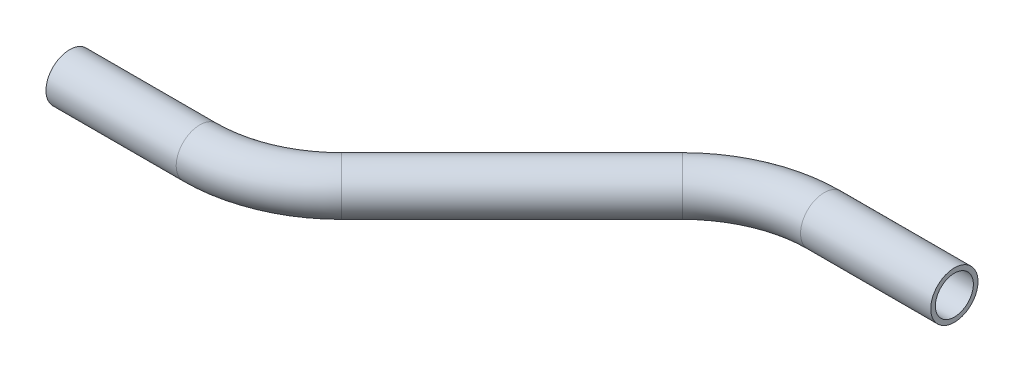
ISO-10303-21;
HEADER;
FILE_DESCRIPTION(('STEP AP214'),'2;1');
FILE_NAME('part.step','',(''),(''),'','','');
FILE_SCHEMA(('AUTOMOTIVE_DESIGN { 1 0 10303 214 1 1 1 1 }'));
ENDSEC;
DATA;
#1=APPLICATION_CONTEXT('core data for automotive mechanical design processes');
#2=APPLICATION_PROTOCOL_DEFINITION('international standard','automotive_design',2000,#1);
#3=PRODUCT_CONTEXT('',#1,'mechanical');
#4=PRODUCT('Part','Part','',(#3));
#5=PRODUCT_RELATED_PRODUCT_CATEGORY('part','',(#4));
#6=PRODUCT_DEFINITION_FORMATION('','',#4);
#7=PRODUCT_DEFINITION_CONTEXT('part definition',#1,'design');
#8=PRODUCT_DEFINITION('design','',#6,#7);
#9=PRODUCT_DEFINITION_SHAPE('','',#8);
#10=(LENGTH_UNIT() NAMED_UNIT(*) SI_UNIT(.MILLI.,.METRE.));
#11=(NAMED_UNIT(*) PLANE_ANGLE_UNIT() SI_UNIT($,.RADIAN.));
#12=(NAMED_UNIT(*) SI_UNIT($,.STERADIAN.) SOLID_ANGLE_UNIT());
#13=UNCERTAINTY_MEASURE_WITH_UNIT(LENGTH_MEASURE(1.E-05),#10,'distance_accuracy_value','');
#14=(GEOMETRIC_REPRESENTATION_CONTEXT(3) GLOBAL_UNCERTAINTY_ASSIGNED_CONTEXT((#13)) GLOBAL_UNIT_ASSIGNED_CONTEXT((#10,
#11,#12)) REPRESENTATION_CONTEXT('',''));
#15=CARTESIAN_POINT('',(0.,0.,0.));
#16=DIRECTION('',(0.,0.,1.));
#17=DIRECTION('',(1.,0.,0.));
#18=AXIS2_PLACEMENT_3D('',#15,#16,#17);
#19=CARTESIAN_POINT('',(0.,0.,0.));
#20=DIRECTION('',(1.,0.,0.));
#21=DIRECTION('',(0.,0.,-1.));
#22=AXIS2_PLACEMENT_3D('',#19,#20,#21);
#23=CYLINDRICAL_SURFACE('',#22,6.35);
#24=CARTESIAN_POINT('',(35.018463273585,0.,0.));
#25=DIRECTION('',(1.,0.,0.));
#26=DIRECTION('',(0.,0.,-1.));
#27=AXIS2_PLACEMENT_3D('',#24,#25,#26);
#28=CIRCLE('',#27,6.35);
#29=CARTESIAN_POINT('',(35.018463273585,0.,6.34999999999999));
#30=VERTEX_POINT('',#29);
#31=EDGE_CURVE('E60',#30,#30,#28,.T.);
#32=ORIENTED_EDGE('',*,*,#31,.F.);
#33=EDGE_LOOP('',(#32));
#34=FACE_BOUND('',#33,.T.);
#35=CARTESIAN_POINT('',(0.,0.,0.));
#36=DIRECTION('',(1.,0.,0.));
#37=DIRECTION('',(0.,0.,-1.));
#38=AXIS2_PLACEMENT_3D('',#35,#36,#37);
#39=CIRCLE('',#38,6.35);
#40=CARTESIAN_POINT('',(0.,0.,-6.35));
#41=VERTEX_POINT('',#40);
#42=EDGE_CURVE('E57',#41,#41,#39,.T.);
#43=ORIENTED_EDGE('',*,*,#42,.T.);
#44=EDGE_LOOP('',(#43));
#45=FACE_BOUND('',#44,.T.);
#46=ADVANCED_FACE('F36',(#34,#45),#23,.T.);
#47=CARTESIAN_POINT('',(35.018463273585,0.,-38.1));
#48=DIRECTION('',(0.,1.,0.));
#49=DIRECTION('',(0.,0.,1.));
#50=AXIS2_PLACEMENT_3D('',#47,#48,#49);
#51=TOROIDAL_SURFACE('',#50,38.1,6.35);
#52=CARTESIAN_POINT('',(61.9592316367926,0.,-11.1592316367926));
#53=DIRECTION('',(0.707106781186546,0.,-0.707106781186549));
#54=DIRECTION('',(-0.707106781186549,0.,-0.707106781186546));
#55=AXIS2_PLACEMENT_3D('',#52,#53,#54);
#56=CIRCLE('',#55,6.35);
#57=CARTESIAN_POINT('',(66.4493596973271,0.,-6.66910357625802));
#58=VERTEX_POINT('',#57);
#59=EDGE_CURVE('E63',#58,#58,#56,.T.);
#60=CARTESIAN_POINT('',(35.018463273585,0.,-38.1));
#61=DIRECTION('',(0.,1.,0.));
#62=DIRECTION('',(0.,0.,1.));
#63=AXIS2_PLACEMENT_3D('',#60,#61,#62);
#64=CIRCLE('',#63,44.45);
#65=EDGE_CURVE('',#30,#58,#64,.T.);
#66=ORIENTED_EDGE('',*,*,#31,.T.);
#67=ORIENTED_EDGE('',*,*,#59,.F.);
#68=ORIENTED_EDGE('',*,*,#65,.T.);
#69=ORIENTED_EDGE('',*,*,#65,.F.);
#70=EDGE_LOOP('',(#66,#68,#67,#69));
#71=FACE_BOUND('',#70,.T.);
#72=ADVANCED_FACE('F82',(#71),#51,.T.);
#73=CARTESIAN_POINT('',(61.9592316367926,0.,-11.1592316367926));
#74=DIRECTION('',(0.707106781186546,0.,-0.707106781186549));
#75=DIRECTION('',(-0.707106781186549,0.,-0.707106781186546));
#76=AXIS2_PLACEMENT_3D('',#73,#74,#75);
#77=CYLINDRICAL_SURFACE('',#76,6.35);
#78=CARTESIAN_POINT('',(107.796909774807,0.,-56.9969097748074));
#79=DIRECTION('',(0.707106781186546,0.,-0.707106781186549));
#80=DIRECTION('',(-0.707106781186549,0.,-0.707106781186546));
#81=AXIS2_PLACEMENT_3D('',#78,#79,#80);
#82=CIRCLE('',#81,6.35);
#83=CARTESIAN_POINT('',(103.306781714273,0.,-61.487037835342));
#84=VERTEX_POINT('',#83);
#85=EDGE_CURVE('E65',#84,#84,#82,.T.);
#86=ORIENTED_EDGE('',*,*,#85,.F.);
#87=EDGE_LOOP('',(#86));
#88=FACE_BOUND('',#87,.T.);
#89=ORIENTED_EDGE('',*,*,#59,.T.);
#90=EDGE_LOOP('',(#89));
#91=FACE_BOUND('',#90,.T.);
#92=ADVANCED_FACE('F75',(#88,#91),#77,.T.);
#93=CARTESIAN_POINT('',(134.737678138015,0.,-30.0561414116));
#94=DIRECTION('',(0.,-1.,0.));
#95=DIRECTION('',(0.,0.,-1.));
#96=AXIS2_PLACEMENT_3D('',#93,#94,#95);
#97=TOROIDAL_SURFACE('',#96,38.1,6.35);
#98=CARTESIAN_POINT('',(134.737678138015,0.,-68.1561414116));
#99=DIRECTION('',(1.,0.,0.));
#100=DIRECTION('',(0.,0.,-1.));
#101=AXIS2_PLACEMENT_3D('',#98,#99,#100);
#102=CIRCLE('',#101,6.35);
#103=CARTESIAN_POINT('',(134.737678138015,0.,-74.5061414116));
#104=VERTEX_POINT('',#103);
#105=EDGE_CURVE('E40',#104,#104,#102,.T.);
#106=CARTESIAN_POINT('',(134.737678138015,0.,-30.0561414116));
#107=DIRECTION('',(0.,-1.,0.));
#108=DIRECTION('',(0.,0.,-1.));
#109=AXIS2_PLACEMENT_3D('',#106,#107,#108);
#110=CIRCLE('',#109,44.45);
#111=EDGE_CURVE('',#84,#104,#110,.T.);
#112=ORIENTED_EDGE('',*,*,#85,.T.);
#113=ORIENTED_EDGE('',*,*,#105,.F.);
#114=ORIENTED_EDGE('',*,*,#111,.T.);
#115=ORIENTED_EDGE('',*,*,#111,.F.);
#116=EDGE_LOOP('',(#112,#114,#113,#115));
#117=FACE_BOUND('',#116,.T.);
#118=ADVANCED_FACE('F73',(#117),#97,.T.);
#119=CARTESIAN_POINT('',(134.737678138015,0.,-68.1561414116));
#120=DIRECTION('',(1.,0.,0.));
#121=DIRECTION('',(0.,0.,-1.));
#122=AXIS2_PLACEMENT_3D('',#119,#120,#121);
#123=CYLINDRICAL_SURFACE('',#122,6.35);
#124=CARTESIAN_POINT('',(169.7561414116,0.,-68.1561414116));
#125=DIRECTION('',(1.,0.,0.));
#126=DIRECTION('',(0.,0.,-1.));
#127=AXIS2_PLACEMENT_3D('',#124,#125,#126);
#128=CIRCLE('',#127,6.35);
#129=CARTESIAN_POINT('',(169.7561414116,0.,-74.5061414116));
#130=VERTEX_POINT('',#129);
#131=EDGE_CURVE('E53',#130,#130,#128,.T.);
#132=ORIENTED_EDGE('',*,*,#131,.F.);
#133=EDGE_LOOP('',(#132));
#134=FACE_BOUND('',#133,.T.);
#135=ORIENTED_EDGE('',*,*,#105,.T.);
#136=EDGE_LOOP('',(#135));
#137=FACE_BOUND('',#136,.T.);
#138=ADVANCED_FACE('F38',(#134,#137),#123,.T.);
#139=CARTESIAN_POINT('',(0.,0.,0.));
#140=DIRECTION('',(1.,0.,0.));
#141=DIRECTION('',(0.,0.,-1.));
#142=AXIS2_PLACEMENT_3D('',#139,#140,#141);
#143=PLANE('',#142);
#144=CARTESIAN_POINT('',(0.,0.,0.));
#145=DIRECTION('',(1.,0.,0.));
#146=DIRECTION('',(0.,0.,-1.));
#147=AXIS2_PLACEMENT_3D('',#144,#145,#146);
#148=CIRCLE('',#147,5.1054);
#149=CARTESIAN_POINT('',(0.,0.,-5.1054));
#150=VERTEX_POINT('',#149);
#151=EDGE_CURVE('E56',#150,#150,#148,.F.);
#152=ORIENTED_EDGE('',*,*,#151,.F.);
#153=EDGE_LOOP('',(#152));
#154=FACE_BOUND('',#153,.T.);
#155=ORIENTED_EDGE('',*,*,#42,.F.);
#156=EDGE_LOOP('',(#155));
#157=FACE_BOUND('',#156,.T.);
#158=ADVANCED_FACE('F80',(#154,#157),#143,.F.);
#159=CARTESIAN_POINT('',(169.7561414116,0.,-68.1561414116));
#160=DIRECTION('',(1.,0.,0.));
#161=DIRECTION('',(0.,0.,-1.));
#162=AXIS2_PLACEMENT_3D('',#159,#160,#161);
#163=PLANE('',#162);
#164=CARTESIAN_POINT('',(169.7561414116,0.,-68.1561414116));
#165=DIRECTION('',(1.,0.,0.));
#166=DIRECTION('',(0.,0.,-1.));
#167=AXIS2_PLACEMENT_3D('',#164,#165,#166);
#168=CIRCLE('',#167,5.1054);
#169=CARTESIAN_POINT('',(169.7561414116,0.,-73.2615414116));
#170=VERTEX_POINT('',#169);
#171=EDGE_CURVE('E10',#170,#170,#168,.F.);
#172=ORIENTED_EDGE('',*,*,#171,.T.);
#173=EDGE_LOOP('',(#172));
#174=FACE_BOUND('',#173,.T.);
#175=ORIENTED_EDGE('',*,*,#131,.T.);
#176=EDGE_LOOP('',(#175));
#177=FACE_BOUND('',#176,.T.);
#178=ADVANCED_FACE('F99',(#174,#177),#163,.T.);
#179=CARTESIAN_POINT('',(0.,0.,0.));
#180=DIRECTION('',(1.,0.,0.));
#181=DIRECTION('',(0.,0.,-1.));
#182=AXIS2_PLACEMENT_3D('',#179,#180,#181);
#183=CYLINDRICAL_SURFACE('',#182,5.1054);
#184=CARTESIAN_POINT('',(35.018463273585,0.,0.));
#185=DIRECTION('',(1.,0.,0.));
#186=DIRECTION('',(0.,0.,-1.));
#187=AXIS2_PLACEMENT_3D('',#184,#185,#186);
#188=CIRCLE('',#187,5.1054);
#189=CARTESIAN_POINT('',(35.018463273585,0.,5.10539999999999));
#190=VERTEX_POINT('',#189);
#191=EDGE_CURVE('E196',#190,#190,#188,.F.);
#192=ORIENTED_EDGE('',*,*,#191,.F.);
#193=EDGE_LOOP('',(#192));
#194=FACE_BOUND('',#193,.T.);
#195=ORIENTED_EDGE('',*,*,#151,.T.);
#196=EDGE_LOOP('',(#195));
#197=FACE_BOUND('',#196,.T.);
#198=ADVANCED_FACE('F102',(#194,#197),#183,.F.);
#199=CARTESIAN_POINT('',(35.018463273585,0.,-38.1));
#200=DIRECTION('',(0.,1.,0.));
#201=DIRECTION('',(0.,0.,1.));
#202=AXIS2_PLACEMENT_3D('',#199,#200,#201);
#203=TOROIDAL_SURFACE('',#202,38.1,5.1054);
#204=CARTESIAN_POINT('',(61.9592316367926,0.,-11.1592316367926));
#205=DIRECTION('',(0.707106781186546,0.,-0.707106781186549));
#206=DIRECTION('',(-0.707106781186549,0.,-0.707106781186546));
#207=AXIS2_PLACEMENT_3D('',#204,#205,#206);
#208=CIRCLE('',#207,5.1054);
#209=CARTESIAN_POINT('',(65.5692945974624,0.,-7.5491686761228));
#210=VERTEX_POINT('',#209);
#211=EDGE_CURVE('E195',#210,#210,#208,.F.);
#212=CARTESIAN_POINT('',(35.018463273585,0.,-38.1));
#213=DIRECTION('',(0.,1.,0.));
#214=DIRECTION('',(0.,0.,1.));
#215=AXIS2_PLACEMENT_3D('',#212,#213,#214);
#216=CIRCLE('',#215,43.2054);
#217=EDGE_CURVE('',#190,#210,#216,.T.);
#218=ORIENTED_EDGE('',*,*,#191,.T.);
#219=ORIENTED_EDGE('',*,*,#211,.F.);
#220=ORIENTED_EDGE('',*,*,#217,.T.);
#221=ORIENTED_EDGE('',*,*,#217,.F.);
#222=EDGE_LOOP('',(#218,#220,#219,#221));
#223=FACE_BOUND('',#222,.T.);
#224=ADVANCED_FACE('F158',(#223),#203,.F.);
#225=CARTESIAN_POINT('',(61.9592316367926,0.,-11.1592316367926));
#226=DIRECTION('',(0.707106781186546,0.,-0.707106781186549));
#227=DIRECTION('',(-0.707106781186549,0.,-0.707106781186546));
#228=AXIS2_PLACEMENT_3D('',#225,#226,#227);
#229=CYLINDRICAL_SURFACE('',#228,5.1054);
#230=CARTESIAN_POINT('',(107.796909774807,0.,-56.9969097748074));
#231=DIRECTION('',(0.707106781186546,0.,-0.707106781186549));
#232=DIRECTION('',(-0.707106781186549,0.,-0.707106781186546));
#233=AXIS2_PLACEMENT_3D('',#230,#231,#232);
#234=CIRCLE('',#233,5.1054);
#235=CARTESIAN_POINT('',(104.186846814137,0.,-60.6069727354772));
#236=VERTEX_POINT('',#235);
#237=EDGE_CURVE('E49',#236,#236,#234,.F.);
#238=ORIENTED_EDGE('',*,*,#237,.F.);
#239=EDGE_LOOP('',(#238));
#240=FACE_BOUND('',#239,.T.);
#241=ORIENTED_EDGE('',*,*,#211,.T.);
#242=EDGE_LOOP('',(#241));
#243=FACE_BOUND('',#242,.T.);
#244=ADVANCED_FACE('F93',(#240,#243),#229,.F.);
#245=CARTESIAN_POINT('',(134.737678138015,0.,-30.0561414116));
#246=DIRECTION('',(0.,-1.,0.));
#247=DIRECTION('',(0.,0.,-1.));
#248=AXIS2_PLACEMENT_3D('',#245,#246,#247);
#249=TOROIDAL_SURFACE('',#248,38.1,5.1054);
#250=CARTESIAN_POINT('',(134.737678138015,0.,-68.1561414116));
#251=DIRECTION('',(1.,0.,0.));
#252=DIRECTION('',(0.,0.,-1.));
#253=AXIS2_PLACEMENT_3D('',#250,#251,#252);
#254=CIRCLE('',#253,5.1054);
#255=CARTESIAN_POINT('',(134.737678138015,0.,-73.2615414116));
#256=VERTEX_POINT('',#255);
#257=EDGE_CURVE('E44',#256,#256,#254,.F.);
#258=CARTESIAN_POINT('',(134.737678138015,0.,-30.0561414116));
#259=DIRECTION('',(0.,-1.,0.));
#260=DIRECTION('',(0.,0.,-1.));
#261=AXIS2_PLACEMENT_3D('',#258,#259,#260);
#262=CIRCLE('',#261,43.2054);
#263=EDGE_CURVE('',#236,#256,#262,.T.);
#264=ORIENTED_EDGE('',*,*,#237,.T.);
#265=ORIENTED_EDGE('',*,*,#257,.F.);
#266=ORIENTED_EDGE('',*,*,#263,.T.);
#267=ORIENTED_EDGE('',*,*,#263,.F.);
#268=EDGE_LOOP('',(#264,#266,#265,#267));
#269=FACE_BOUND('',#268,.T.);
#270=ADVANCED_FACE('F87',(#269),#249,.F.);
#271=CARTESIAN_POINT('',(134.737678138015,0.,-68.1561414116));
#272=DIRECTION('',(1.,0.,0.));
#273=DIRECTION('',(0.,0.,-1.));
#274=AXIS2_PLACEMENT_3D('',#271,#272,#273);
#275=CYLINDRICAL_SURFACE('',#274,5.1054);
#276=ORIENTED_EDGE('',*,*,#171,.F.);
#277=EDGE_LOOP('',(#276));
#278=FACE_BOUND('',#277,.T.);
#279=ORIENTED_EDGE('',*,*,#257,.T.);
#280=EDGE_LOOP('',(#279));
#281=FACE_BOUND('',#280,.T.);
#282=ADVANCED_FACE('F85',(#278,#281),#275,.F.);
#283=CLOSED_SHELL('',(#46,#72,#92,#118,#138,#158,#178,#198,#224,#244,#270,#282));
#284=MANIFOLD_SOLID_BREP('B2',#283);
#285=ADVANCED_BREP_SHAPE_REPRESENTATION('',(#18,#284),#14);
#286=SHAPE_DEFINITION_REPRESENTATION(#9,#285);
ENDSEC;
END-ISO-10303-21;
